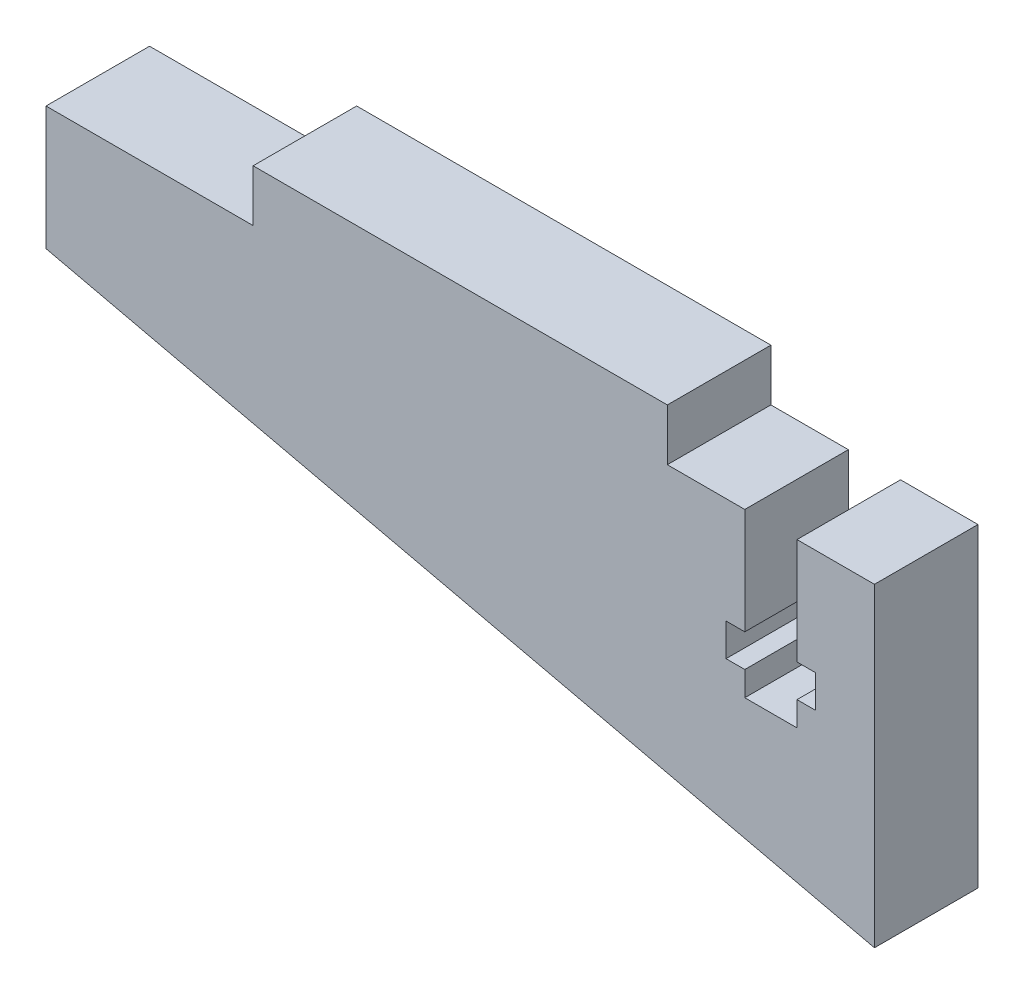
ISO-10303-21;
HEADER;
FILE_DESCRIPTION(('STEP AP214'),'2;1');
FILE_NAME('part.step','',(''),(''),'','','');
FILE_SCHEMA(('AUTOMOTIVE_DESIGN { 1 0 10303 214 1 1 1 1 }'));
ENDSEC;
DATA;
#1=APPLICATION_CONTEXT('core data for automotive mechanical design processes');
#2=APPLICATION_PROTOCOL_DEFINITION('international standard','automotive_design',2000,#1);
#3=PRODUCT_CONTEXT('',#1,'mechanical');
#4=PRODUCT('Part','Part','',(#3));
#5=PRODUCT_RELATED_PRODUCT_CATEGORY('part','',(#4));
#6=PRODUCT_DEFINITION_FORMATION('','',#4);
#7=PRODUCT_DEFINITION_CONTEXT('part definition',#1,'design');
#8=PRODUCT_DEFINITION('design','',#6,#7);
#9=PRODUCT_DEFINITION_SHAPE('','',#8);
#10=(LENGTH_UNIT() NAMED_UNIT(*) SI_UNIT(.MILLI.,.METRE.));
#11=(NAMED_UNIT(*) PLANE_ANGLE_UNIT() SI_UNIT($,.RADIAN.));
#12=(NAMED_UNIT(*) SI_UNIT($,.STERADIAN.) SOLID_ANGLE_UNIT());
#13=UNCERTAINTY_MEASURE_WITH_UNIT(LENGTH_MEASURE(1.E-05),#10,'distance_accuracy_value','');
#14=(GEOMETRIC_REPRESENTATION_CONTEXT(3) GLOBAL_UNCERTAINTY_ASSIGNED_CONTEXT((#13)) GLOBAL_UNIT_ASSIGNED_CONTEXT((#10,
#11,#12)) REPRESENTATION_CONTEXT('',''));
#15=CARTESIAN_POINT('',(0.,0.,0.));
#16=DIRECTION('',(0.,0.,1.));
#17=DIRECTION('',(1.,0.,0.));
#18=AXIS2_PLACEMENT_3D('',#15,#16,#17);
#19=CARTESIAN_POINT('',(14.9369879214621,19.13739489604,6.35));
#20=DIRECTION('',(-1.,0.,0.));
#21=DIRECTION('',(0.,0.,1.));
#22=AXIS2_PLACEMENT_3D('',#19,#20,#21);
#23=PLANE('',#22);
#24=DIRECTION('',(0.,1.,0.));
#25=VECTOR('',#24,1.);
#26=CARTESIAN_POINT('',(14.9369879214621,19.13739489604,0.));
#27=LINE('',#26,#25);
#28=CARTESIAN_POINT('',(14.9369879214621,19.13739489604,0.));
#29=VERTEX_POINT('',#28);
#30=CARTESIAN_POINT('',(14.9369879214621,22.3123948960401,0.));
#31=VERTEX_POINT('',#30);
#32=EDGE_CURVE('E201',#29,#31,#27,.T.);
#33=ORIENTED_EDGE('',*,*,#32,.F.);
#34=DIRECTION('',(0.,0.,-1.));
#35=VECTOR('',#34,1.);
#36=CARTESIAN_POINT('',(14.9369879214621,19.13739489604,6.35));
#37=LINE('',#36,#35);
#38=CARTESIAN_POINT('',(14.9369879214621,19.13739489604,6.35));
#39=VERTEX_POINT('',#38);
#40=EDGE_CURVE('E11',#39,#29,#37,.T.);
#41=ORIENTED_EDGE('',*,*,#40,.F.);
#42=DIRECTION('',(0.,1.,0.));
#43=VECTOR('',#42,1.);
#44=CARTESIAN_POINT('',(14.9369879214621,19.13739489604,6.35));
#45=LINE('',#44,#43);
#46=CARTESIAN_POINT('',(14.9369879214621,22.3123948960401,6.35));
#47=VERTEX_POINT('',#46);
#48=EDGE_CURVE('E255',#39,#47,#45,.T.);
#49=ORIENTED_EDGE('',*,*,#48,.T.);
#50=DIRECTION('',(0.,0.,-1.));
#51=VECTOR('',#50,1.);
#52=CARTESIAN_POINT('',(14.9369879214621,22.3123948960401,6.35));
#53=LINE('',#52,#51);
#54=EDGE_CURVE('E36',#47,#31,#53,.T.);
#55=ORIENTED_EDGE('',*,*,#54,.T.);
#56=EDGE_LOOP('',(#33,#41,#49,#55));
#57=FACE_BOUND('',#56,.T.);
#58=ADVANCED_FACE('F33',(#57),#23,.T.);
#59=CARTESIAN_POINT('',(2.23698792146213,19.13739489604,6.35));
#60=DIRECTION('',(0.,1.,0.));
#61=DIRECTION('',(0.,0.,1.));
#62=AXIS2_PLACEMENT_3D('',#59,#60,#61);
#63=PLANE('',#62);
#64=DIRECTION('',(1.,0.,0.));
#65=VECTOR('',#64,1.);
#66=CARTESIAN_POINT('',(2.23698792146213,19.13739489604,0.));
#67=LINE('',#66,#65);
#68=CARTESIAN_POINT('',(2.23698792146213,19.13739489604,0.));
#69=VERTEX_POINT('',#68);
#70=EDGE_CURVE('E253',#69,#29,#67,.T.);
#71=ORIENTED_EDGE('',*,*,#70,.F.);
#72=DIRECTION('',(0.,0.,-1.));
#73=VECTOR('',#72,1.);
#74=CARTESIAN_POINT('',(2.23698792146213,19.13739489604,6.35));
#75=LINE('',#74,#73);
#76=CARTESIAN_POINT('',(2.23698792146213,19.13739489604,6.35));
#77=VERTEX_POINT('',#76);
#78=EDGE_CURVE('E42',#77,#69,#75,.T.);
#79=ORIENTED_EDGE('',*,*,#78,.F.);
#80=DIRECTION('',(1.,0.,0.));
#81=VECTOR('',#80,1.);
#82=CARTESIAN_POINT('',(2.23698792146213,19.13739489604,6.35));
#83=LINE('',#82,#81);
#84=EDGE_CURVE('E190',#77,#39,#83,.T.);
#85=ORIENTED_EDGE('',*,*,#84,.T.);
#86=ORIENTED_EDGE('',*,*,#40,.T.);
#87=EDGE_LOOP('',(#71,#79,#85,#86));
#88=FACE_BOUND('',#87,.T.);
#89=ADVANCED_FACE('F294',(#88),#63,.T.);
#90=CARTESIAN_POINT('',(2.23698792146213,11.5614990052185,6.35));
#91=DIRECTION('',(-1.,0.,0.));
#92=DIRECTION('',(0.,-1.,0.));
#93=AXIS2_PLACEMENT_3D('',#90,#91,#92);
#94=PLANE('',#93);
#95=DIRECTION('',(0.,1.,0.));
#96=VECTOR('',#95,1.);
#97=CARTESIAN_POINT('',(2.23698792146213,11.5614990052185,0.));
#98=LINE('',#97,#96);
#99=CARTESIAN_POINT('',(2.23698792146213,11.5614990052185,0.));
#100=VERTEX_POINT('',#99);
#101=EDGE_CURVE('E179',#100,#69,#98,.T.);
#102=ORIENTED_EDGE('',*,*,#101,.F.);
#103=DIRECTION('',(0.,0.,-1.));
#104=VECTOR('',#103,1.);
#105=CARTESIAN_POINT('',(2.23698792146213,11.5614990052185,6.35));
#106=LINE('',#105,#104);
#107=CARTESIAN_POINT('',(2.23698792146213,11.5614990052185,6.35));
#108=VERTEX_POINT('',#107);
#109=EDGE_CURVE('E174',#108,#100,#106,.T.);
#110=ORIENTED_EDGE('',*,*,#109,.F.);
#111=DIRECTION('',(0.,1.,0.));
#112=VECTOR('',#111,1.);
#113=CARTESIAN_POINT('',(2.23698792146213,11.5614990052185,6.35));
#114=LINE('',#113,#112);
#115=EDGE_CURVE('E177',#108,#77,#114,.T.);
#116=ORIENTED_EDGE('',*,*,#115,.T.);
#117=ORIENTED_EDGE('',*,*,#78,.T.);
#118=EDGE_LOOP('',(#102,#110,#116,#117));
#119=FACE_BOUND('',#118,.T.);
#120=ADVANCED_FACE('F176',(#119),#94,.T.);
#121=CARTESIAN_POINT('',(53.0369879214621,-0.166605103959949,6.35));
#122=DIRECTION('',(-0.224951054343861,-0.974370064785236,0.));
#123=DIRECTION('',(0.974370064785236,-0.224951054343862,0.));
#124=AXIS2_PLACEMENT_3D('',#121,#122,#123);
#125=PLANE('',#124);
#126=DIRECTION('',(-0.974370064785236,0.224951054343861,0.));
#127=VECTOR('',#126,1.);
#128=CARTESIAN_POINT('',(53.0369879214621,-0.166605103959949,0.));
#129=LINE('',#128,#127);
#130=CARTESIAN_POINT('',(53.0369879214621,-0.166605103959949,0.));
#131=VERTEX_POINT('',#130);
#132=EDGE_CURVE('E250',#131,#100,#129,.T.);
#133=ORIENTED_EDGE('',*,*,#132,.F.);
#134=DIRECTION('',(0.,0.,-1.));
#135=VECTOR('',#134,1.);
#136=CARTESIAN_POINT('',(53.0369879214621,-0.166605103959949,6.35));
#137=LINE('',#136,#135);
#138=CARTESIAN_POINT('',(53.0369879214621,-0.166605103959949,6.35));
#139=VERTEX_POINT('',#138);
#140=EDGE_CURVE('E184',#139,#131,#137,.T.);
#141=ORIENTED_EDGE('',*,*,#140,.F.);
#142=DIRECTION('',(-0.974370064785236,0.224951054343861,0.));
#143=VECTOR('',#142,1.);
#144=CARTESIAN_POINT('',(53.0369879214621,-0.166605103959949,6.35));
#145=LINE('',#144,#143);
#146=EDGE_CURVE('E189',#139,#108,#145,.T.);
#147=ORIENTED_EDGE('',*,*,#146,.T.);
#148=ORIENTED_EDGE('',*,*,#109,.T.);
#149=EDGE_LOOP('',(#133,#141,#147,#148));
#150=FACE_BOUND('',#149,.T.);
#151=ADVANCED_FACE('F192',(#150),#125,.T.);
#152=CARTESIAN_POINT('',(53.0369879214621,-0.166605103959949,6.35));
#153=DIRECTION('',(-1.,0.,0.));
#154=DIRECTION('',(0.,0.,1.));
#155=AXIS2_PLACEMENT_3D('',#152,#153,#154);
#156=PLANE('',#155);
#157=DIRECTION('',(0.,1.,0.));
#158=VECTOR('',#157,1.);
#159=CARTESIAN_POINT('',(53.0369879214621,-0.166605103959949,0.));
#160=LINE('',#159,#158);
#161=CARTESIAN_POINT('',(53.0369879214621,19.13739489604,0.));
#162=VERTEX_POINT('',#161);
#163=EDGE_CURVE('E247',#131,#162,#160,.T.);
#164=ORIENTED_EDGE('',*,*,#163,.T.);
#165=DIRECTION('',(0.,0.,-1.));
#166=VECTOR('',#165,1.);
#167=CARTESIAN_POINT('',(53.0369879214621,19.13739489604,6.35));
#168=LINE('',#167,#166);
#169=CARTESIAN_POINT('',(53.0369879214621,19.13739489604,6.35));
#170=VERTEX_POINT('',#169);
#171=EDGE_CURVE('E259',#170,#162,#168,.T.);
#172=ORIENTED_EDGE('',*,*,#171,.F.);
#173=DIRECTION('',(0.,1.,0.));
#174=VECTOR('',#173,1.);
#175=CARTESIAN_POINT('',(53.0369879214621,-0.166605103959949,6.35));
#176=LINE('',#175,#174);
#177=EDGE_CURVE('E194',#139,#170,#176,.T.);
#178=ORIENTED_EDGE('',*,*,#177,.F.);
#179=ORIENTED_EDGE('',*,*,#140,.T.);
#180=EDGE_LOOP('',(#164,#172,#178,#179));
#181=FACE_BOUND('',#180,.T.);
#182=ADVANCED_FACE('F307',(#181),#156,.F.);
#183=CARTESIAN_POINT('',(48.2869879214621,19.13739489604,6.35));
#184=DIRECTION('',(0.,1.,0.));
#185=DIRECTION('',(0.,0.,1.));
#186=AXIS2_PLACEMENT_3D('',#183,#184,#185);
#187=PLANE('',#186);
#188=DIRECTION('',(1.,0.,0.));
#189=VECTOR('',#188,1.);
#190=CARTESIAN_POINT('',(48.2869879214621,19.13739489604,0.));
#191=LINE('',#190,#189);
#192=CARTESIAN_POINT('',(48.2869879214621,19.13739489604,0.));
#193=VERTEX_POINT('',#192);
#194=EDGE_CURVE('E244',#193,#162,#191,.T.);
#195=ORIENTED_EDGE('',*,*,#194,.F.);
#196=DIRECTION('',(0.,0.,-1.));
#197=VECTOR('',#196,1.);
#198=CARTESIAN_POINT('',(48.2869879214621,19.13739489604,6.35));
#199=LINE('',#198,#197);
#200=CARTESIAN_POINT('',(48.2869879214621,19.13739489604,6.35));
#201=VERTEX_POINT('',#200);
#202=EDGE_CURVE('E261',#201,#193,#199,.T.);
#203=ORIENTED_EDGE('',*,*,#202,.F.);
#204=DIRECTION('',(1.,0.,0.));
#205=VECTOR('',#204,1.);
#206=CARTESIAN_POINT('',(48.2869879214621,19.13739489604,6.35));
#207=LINE('',#206,#205);
#208=EDGE_CURVE('E196',#201,#170,#207,.T.);
#209=ORIENTED_EDGE('',*,*,#208,.T.);
#210=ORIENTED_EDGE('',*,*,#171,.T.);
#211=EDGE_LOOP('',(#195,#203,#209,#210));
#212=FACE_BOUND('',#211,.T.);
#213=ADVANCED_FACE('F310',(#212),#187,.T.);
#214=CARTESIAN_POINT('',(48.2869879214621,19.13739489604,6.35));
#215=DIRECTION('',(1.,0.,0.));
#216=DIRECTION('',(0.,0.,-1.));
#217=AXIS2_PLACEMENT_3D('',#214,#215,#216);
#218=PLANE('',#217);
#219=DIRECTION('',(0.,-1.,0.));
#220=VECTOR('',#219,1.);
#221=CARTESIAN_POINT('',(48.2869879214621,19.13739489604,0.));
#222=LINE('',#221,#220);
#223=CARTESIAN_POINT('',(48.2869879214621,12.6373948960401,0.));
#224=VERTEX_POINT('',#223);
#225=EDGE_CURVE('E242',#193,#224,#222,.T.);
#226=ORIENTED_EDGE('',*,*,#225,.T.);
#227=DIRECTION('',(0.,0.,-1.));
#228=VECTOR('',#227,1.);
#229=CARTESIAN_POINT('',(48.2869879214621,12.6373948960401,6.35));
#230=LINE('',#229,#228);
#231=CARTESIAN_POINT('',(48.2869879214621,12.6373948960401,6.35));
#232=VERTEX_POINT('',#231);
#233=EDGE_CURVE('E263',#232,#224,#230,.T.);
#234=ORIENTED_EDGE('',*,*,#233,.F.);
#235=DIRECTION('',(0.,-1.,0.));
#236=VECTOR('',#235,1.);
#237=CARTESIAN_POINT('',(48.2869879214621,19.13739489604,6.35));
#238=LINE('',#237,#236);
#239=EDGE_CURVE('E543',#201,#232,#238,.T.);
#240=ORIENTED_EDGE('',*,*,#239,.F.);
#241=ORIENTED_EDGE('',*,*,#202,.T.);
#242=EDGE_LOOP('',(#226,#234,#240,#241));
#243=FACE_BOUND('',#242,.T.);
#244=ADVANCED_FACE('F314',(#243),#218,.F.);
#245=CARTESIAN_POINT('',(48.2869879214621,12.6373948960401,6.35));
#246=DIRECTION('',(0.,1.,0.));
#247=DIRECTION('',(-1.,0.,0.));
#248=AXIS2_PLACEMENT_3D('',#245,#246,#247);
#249=PLANE('',#248);
#250=DIRECTION('',(1.,0.,0.));
#251=VECTOR('',#250,1.);
#252=CARTESIAN_POINT('',(48.2869879214621,12.6373948960401,0.));
#253=LINE('',#252,#251);
#254=CARTESIAN_POINT('',(49.4369879214621,12.6373948960401,0.));
#255=VERTEX_POINT('',#254);
#256=EDGE_CURVE('E240',#224,#255,#253,.T.);
#257=ORIENTED_EDGE('',*,*,#256,.T.);
#258=DIRECTION('',(0.,0.,-1.));
#259=VECTOR('',#258,1.);
#260=CARTESIAN_POINT('',(49.4369879214621,12.6373948960401,6.35));
#261=LINE('',#260,#259);
#262=CARTESIAN_POINT('',(49.4369879214621,12.6373948960401,6.35));
#263=VERTEX_POINT('',#262);
#264=EDGE_CURVE('E266',#263,#255,#261,.T.);
#265=ORIENTED_EDGE('',*,*,#264,.F.);
#266=DIRECTION('',(1.,0.,0.));
#267=VECTOR('',#266,1.);
#268=CARTESIAN_POINT('',(48.2869879214621,12.6373948960401,6.35));
#269=LINE('',#268,#267);
#270=EDGE_CURVE('E541',#232,#263,#269,.T.);
#271=ORIENTED_EDGE('',*,*,#270,.F.);
#272=ORIENTED_EDGE('',*,*,#233,.T.);
#273=EDGE_LOOP('',(#257,#265,#271,#272));
#274=FACE_BOUND('',#273,.T.);
#275=ADVANCED_FACE('F318',(#274),#249,.F.);
#276=CARTESIAN_POINT('',(49.4369879214621,12.6373948960401,6.35));
#277=DIRECTION('',(1.,0.,0.));
#278=DIRECTION('',(0.,0.,-1.));
#279=AXIS2_PLACEMENT_3D('',#276,#277,#278);
#280=PLANE('',#279);
#281=DIRECTION('',(0.,-1.,0.));
#282=VECTOR('',#281,1.);
#283=CARTESIAN_POINT('',(49.4369879214621,12.6373948960401,0.));
#284=LINE('',#283,#282);
#285=CARTESIAN_POINT('',(49.4369879214621,10.6373948960401,0.));
#286=VERTEX_POINT('',#285);
#287=EDGE_CURVE('E237',#255,#286,#284,.T.);
#288=ORIENTED_EDGE('',*,*,#287,.T.);
#289=DIRECTION('',(0.,0.,-1.));
#290=VECTOR('',#289,1.);
#291=CARTESIAN_POINT('',(49.4369879214621,10.6373948960401,6.35));
#292=LINE('',#291,#290);
#293=CARTESIAN_POINT('',(49.4369879214621,10.6373948960401,6.35));
#294=VERTEX_POINT('',#293);
#295=EDGE_CURVE('E269',#294,#286,#292,.T.);
#296=ORIENTED_EDGE('',*,*,#295,.F.);
#297=DIRECTION('',(0.,-1.,0.));
#298=VECTOR('',#297,1.);
#299=CARTESIAN_POINT('',(49.4369879214621,12.6373948960401,6.35));
#300=LINE('',#299,#298);
#301=EDGE_CURVE('E551',#263,#294,#300,.T.);
#302=ORIENTED_EDGE('',*,*,#301,.F.);
#303=ORIENTED_EDGE('',*,*,#264,.T.);
#304=EDGE_LOOP('',(#288,#296,#302,#303));
#305=FACE_BOUND('',#304,.T.);
#306=ADVANCED_FACE('F322',(#305),#280,.F.);
#307=CARTESIAN_POINT('',(48.2869879214621,10.63739489604,6.35));
#308=DIRECTION('',(0.,1.,0.));
#309=DIRECTION('',(-1.,0.,0.));
#310=AXIS2_PLACEMENT_3D('',#307,#308,#309);
#311=PLANE('',#310);
#312=DIRECTION('',(1.,0.,0.));
#313=VECTOR('',#312,1.);
#314=CARTESIAN_POINT('',(48.2869879214621,10.63739489604,0.));
#315=LINE('',#314,#313);
#316=CARTESIAN_POINT('',(48.2869879214621,10.63739489604,0.));
#317=VERTEX_POINT('',#316);
#318=EDGE_CURVE('E234',#317,#286,#315,.T.);
#319=ORIENTED_EDGE('',*,*,#318,.F.);
#320=DIRECTION('',(0.,0.,-1.));
#321=VECTOR('',#320,1.);
#322=CARTESIAN_POINT('',(48.2869879214621,10.63739489604,6.35));
#323=LINE('',#322,#321);
#324=CARTESIAN_POINT('',(48.2869879214621,10.63739489604,6.35));
#325=VERTEX_POINT('',#324);
#326=EDGE_CURVE('E271',#325,#317,#323,.T.);
#327=ORIENTED_EDGE('',*,*,#326,.F.);
#328=DIRECTION('',(1.,0.,0.));
#329=VECTOR('',#328,1.);
#330=CARTESIAN_POINT('',(48.2869879214621,10.63739489604,6.35));
#331=LINE('',#330,#329);
#332=EDGE_CURVE('E533',#325,#294,#331,.T.);
#333=ORIENTED_EDGE('',*,*,#332,.T.);
#334=ORIENTED_EDGE('',*,*,#295,.T.);
#335=EDGE_LOOP('',(#319,#327,#333,#334));
#336=FACE_BOUND('',#335,.T.);
#337=ADVANCED_FACE('F326',(#336),#311,.T.);
#338=CARTESIAN_POINT('',(48.2869879214621,10.63739489604,6.35));
#339=DIRECTION('',(1.,0.,0.));
#340=DIRECTION('',(0.,0.,-1.));
#341=AXIS2_PLACEMENT_3D('',#338,#339,#340);
#342=PLANE('',#341);
#343=DIRECTION('',(0.,-1.,0.));
#344=VECTOR('',#343,1.);
#345=CARTESIAN_POINT('',(48.2869879214621,10.63739489604,0.));
#346=LINE('',#345,#344);
#347=CARTESIAN_POINT('',(48.2869879214621,9.13739489604005,0.));
#348=VERTEX_POINT('',#347);
#349=EDGE_CURVE('E231',#317,#348,#346,.T.);
#350=ORIENTED_EDGE('',*,*,#349,.T.);
#351=DIRECTION('',(0.,0.,-1.));
#352=VECTOR('',#351,1.);
#353=CARTESIAN_POINT('',(48.2869879214621,9.13739489604005,6.35));
#354=LINE('',#353,#352);
#355=CARTESIAN_POINT('',(48.2869879214621,9.13739489604005,6.35));
#356=VERTEX_POINT('',#355);
#357=EDGE_CURVE('E273',#356,#348,#354,.T.);
#358=ORIENTED_EDGE('',*,*,#357,.F.);
#359=DIRECTION('',(0.,-1.,0.));
#360=VECTOR('',#359,1.);
#361=CARTESIAN_POINT('',(48.2869879214621,10.63739489604,6.35));
#362=LINE('',#361,#360);
#363=EDGE_CURVE('E554',#325,#356,#362,.T.);
#364=ORIENTED_EDGE('',*,*,#363,.F.);
#365=ORIENTED_EDGE('',*,*,#326,.T.);
#366=EDGE_LOOP('',(#350,#358,#364,#365));
#367=FACE_BOUND('',#366,.T.);
#368=ADVANCED_FACE('F330',(#367),#342,.F.);
#369=CARTESIAN_POINT('',(45.0869879214621,9.13739489604005,6.35));
#370=DIRECTION('',(0.,1.,0.));
#371=DIRECTION('',(0.,0.,1.));
#372=AXIS2_PLACEMENT_3D('',#369,#370,#371);
#373=PLANE('',#372);
#374=DIRECTION('',(1.,0.,0.));
#375=VECTOR('',#374,1.);
#376=CARTESIAN_POINT('',(45.0869879214621,9.13739489604005,0.));
#377=LINE('',#376,#375);
#378=CARTESIAN_POINT('',(45.0869879214621,9.13739489604005,0.));
#379=VERTEX_POINT('',#378);
#380=EDGE_CURVE('E228',#379,#348,#377,.T.);
#381=ORIENTED_EDGE('',*,*,#380,.F.);
#382=DIRECTION('',(0.,0.,-1.));
#383=VECTOR('',#382,1.);
#384=CARTESIAN_POINT('',(45.0869879214621,9.13739489604005,6.35));
#385=LINE('',#384,#383);
#386=CARTESIAN_POINT('',(45.0869879214621,9.13739489604005,6.35));
#387=VERTEX_POINT('',#386);
#388=EDGE_CURVE('E275',#387,#379,#385,.T.);
#389=ORIENTED_EDGE('',*,*,#388,.F.);
#390=DIRECTION('',(1.,0.,0.));
#391=VECTOR('',#390,1.);
#392=CARTESIAN_POINT('',(45.0869879214621,9.13739489604005,6.35));
#393=LINE('',#392,#391);
#394=EDGE_CURVE('E556',#387,#356,#393,.T.);
#395=ORIENTED_EDGE('',*,*,#394,.T.);
#396=ORIENTED_EDGE('',*,*,#357,.T.);
#397=EDGE_LOOP('',(#381,#389,#395,#396));
#398=FACE_BOUND('',#397,.T.);
#399=ADVANCED_FACE('F334',(#398),#373,.T.);
#400=CARTESIAN_POINT('',(45.0869879214621,10.63739489604,6.35));
#401=DIRECTION('',(1.,0.,0.));
#402=DIRECTION('',(0.,0.,-1.));
#403=AXIS2_PLACEMENT_3D('',#400,#401,#402);
#404=PLANE('',#403);
#405=DIRECTION('',(0.,-1.,0.));
#406=VECTOR('',#405,1.);
#407=CARTESIAN_POINT('',(45.0869879214621,10.63739489604,0.));
#408=LINE('',#407,#406);
#409=CARTESIAN_POINT('',(45.0869879214621,10.63739489604,0.));
#410=VERTEX_POINT('',#409);
#411=EDGE_CURVE('E225',#410,#379,#408,.T.);
#412=ORIENTED_EDGE('',*,*,#411,.F.);
#413=DIRECTION('',(0.,0.,-1.));
#414=VECTOR('',#413,1.);
#415=CARTESIAN_POINT('',(45.0869879214621,10.63739489604,6.35));
#416=LINE('',#415,#414);
#417=CARTESIAN_POINT('',(45.0869879214621,10.63739489604,6.35));
#418=VERTEX_POINT('',#417);
#419=EDGE_CURVE('E277',#418,#410,#416,.T.);
#420=ORIENTED_EDGE('',*,*,#419,.F.);
#421=DIRECTION('',(0.,-1.,0.));
#422=VECTOR('',#421,1.);
#423=CARTESIAN_POINT('',(45.0869879214621,10.63739489604,6.35));
#424=LINE('',#423,#422);
#425=EDGE_CURVE('E522',#418,#387,#424,.T.);
#426=ORIENTED_EDGE('',*,*,#425,.T.);
#427=ORIENTED_EDGE('',*,*,#388,.T.);
#428=EDGE_LOOP('',(#412,#420,#426,#427));
#429=FACE_BOUND('',#428,.T.);
#430=ADVANCED_FACE('F338',(#429),#404,.T.);
#431=CARTESIAN_POINT('',(45.0869879214621,10.63739489604,6.35));
#432=DIRECTION('',(0.,-1.,0.));
#433=DIRECTION('',(0.,0.,-1.));
#434=AXIS2_PLACEMENT_3D('',#431,#432,#433);
#435=PLANE('',#434);
#436=DIRECTION('',(-1.,0.,0.));
#437=VECTOR('',#436,1.);
#438=CARTESIAN_POINT('',(45.0869879214621,10.63739489604,0.));
#439=LINE('',#438,#437);
#440=CARTESIAN_POINT('',(43.9369879214621,10.63739489604,0.));
#441=VERTEX_POINT('',#440);
#442=EDGE_CURVE('E222',#410,#441,#439,.T.);
#443=ORIENTED_EDGE('',*,*,#442,.T.);
#444=DIRECTION('',(0.,0.,-1.));
#445=VECTOR('',#444,1.);
#446=CARTESIAN_POINT('',(43.9369879214621,10.63739489604,6.35));
#447=LINE('',#446,#445);
#448=CARTESIAN_POINT('',(43.9369879214621,10.63739489604,6.35));
#449=VERTEX_POINT('',#448);
#450=EDGE_CURVE('E279',#449,#441,#447,.T.);
#451=ORIENTED_EDGE('',*,*,#450,.F.);
#452=DIRECTION('',(-1.,0.,0.));
#453=VECTOR('',#452,1.);
#454=CARTESIAN_POINT('',(45.0869879214621,10.63739489604,6.35));
#455=LINE('',#454,#453);
#456=EDGE_CURVE('E559',#418,#449,#455,.T.);
#457=ORIENTED_EDGE('',*,*,#456,.F.);
#458=ORIENTED_EDGE('',*,*,#419,.T.);
#459=EDGE_LOOP('',(#443,#451,#457,#458));
#460=FACE_BOUND('',#459,.T.);
#461=ADVANCED_FACE('F342',(#460),#435,.F.);
#462=CARTESIAN_POINT('',(43.9369879214621,12.6373948960401,6.35));
#463=DIRECTION('',(1.,0.,0.));
#464=DIRECTION('',(0.,0.,-1.));
#465=AXIS2_PLACEMENT_3D('',#462,#463,#464);
#466=PLANE('',#465);
#467=DIRECTION('',(0.,-1.,0.));
#468=VECTOR('',#467,1.);
#469=CARTESIAN_POINT('',(43.9369879214621,12.6373948960401,0.));
#470=LINE('',#469,#468);
#471=CARTESIAN_POINT('',(43.9369879214621,12.6373948960401,0.));
#472=VERTEX_POINT('',#471);
#473=EDGE_CURVE('E219',#472,#441,#470,.T.);
#474=ORIENTED_EDGE('',*,*,#473,.F.);
#475=DIRECTION('',(0.,0.,-1.));
#476=VECTOR('',#475,1.);
#477=CARTESIAN_POINT('',(43.9369879214621,12.6373948960401,6.35));
#478=LINE('',#477,#476);
#479=CARTESIAN_POINT('',(43.9369879214621,12.6373948960401,6.35));
#480=VERTEX_POINT('',#479);
#481=EDGE_CURVE('E281',#480,#472,#478,.T.);
#482=ORIENTED_EDGE('',*,*,#481,.F.);
#483=DIRECTION('',(0.,-1.,0.));
#484=VECTOR('',#483,1.);
#485=CARTESIAN_POINT('',(43.9369879214621,12.6373948960401,6.35));
#486=LINE('',#485,#484);
#487=EDGE_CURVE('E516',#480,#449,#486,.T.);
#488=ORIENTED_EDGE('',*,*,#487,.T.);
#489=ORIENTED_EDGE('',*,*,#450,.T.);
#490=EDGE_LOOP('',(#474,#482,#488,#489));
#491=FACE_BOUND('',#490,.T.);
#492=ADVANCED_FACE('F346',(#491),#466,.T.);
#493=CARTESIAN_POINT('',(45.0869879214621,12.6373948960401,6.35));
#494=DIRECTION('',(0.,-1.,0.));
#495=DIRECTION('',(0.,0.,-1.));
#496=AXIS2_PLACEMENT_3D('',#493,#494,#495);
#497=PLANE('',#496);
#498=DIRECTION('',(-1.,0.,0.));
#499=VECTOR('',#498,1.);
#500=CARTESIAN_POINT('',(45.0869879214621,12.6373948960401,0.));
#501=LINE('',#500,#499);
#502=CARTESIAN_POINT('',(45.0869879214621,12.6373948960401,0.));
#503=VERTEX_POINT('',#502);
#504=EDGE_CURVE('E216',#503,#472,#501,.T.);
#505=ORIENTED_EDGE('',*,*,#504,.F.);
#506=DIRECTION('',(0.,0.,-1.));
#507=VECTOR('',#506,1.);
#508=CARTESIAN_POINT('',(45.0869879214621,12.6373948960401,6.35));
#509=LINE('',#508,#507);
#510=CARTESIAN_POINT('',(45.0869879214621,12.6373948960401,6.35));
#511=VERTEX_POINT('',#510);
#512=EDGE_CURVE('E283',#511,#503,#509,.T.);
#513=ORIENTED_EDGE('',*,*,#512,.F.);
#514=DIRECTION('',(-1.,0.,0.));
#515=VECTOR('',#514,1.);
#516=CARTESIAN_POINT('',(45.0869879214621,12.6373948960401,6.35));
#517=LINE('',#516,#515);
#518=EDGE_CURVE('E512',#511,#480,#517,.T.);
#519=ORIENTED_EDGE('',*,*,#518,.T.);
#520=ORIENTED_EDGE('',*,*,#481,.T.);
#521=EDGE_LOOP('',(#505,#513,#519,#520));
#522=FACE_BOUND('',#521,.T.);
#523=ADVANCED_FACE('F350',(#522),#497,.T.);
#524=CARTESIAN_POINT('',(45.0869879214621,19.13739489604,6.35));
#525=DIRECTION('',(1.,0.,0.));
#526=DIRECTION('',(0.,0.,-1.));
#527=AXIS2_PLACEMENT_3D('',#524,#525,#526);
#528=PLANE('',#527);
#529=DIRECTION('',(0.,-1.,0.));
#530=VECTOR('',#529,1.);
#531=CARTESIAN_POINT('',(45.0869879214621,19.13739489604,0.));
#532=LINE('',#531,#530);
#533=CARTESIAN_POINT('',(45.0869879214621,19.13739489604,0.));
#534=VERTEX_POINT('',#533);
#535=EDGE_CURVE('E213',#534,#503,#532,.T.);
#536=ORIENTED_EDGE('',*,*,#535,.F.);
#537=DIRECTION('',(0.,0.,-1.));
#538=VECTOR('',#537,1.);
#539=CARTESIAN_POINT('',(45.0869879214621,19.13739489604,6.35));
#540=LINE('',#539,#538);
#541=CARTESIAN_POINT('',(45.0869879214621,19.13739489604,6.35));
#542=VERTEX_POINT('',#541);
#543=EDGE_CURVE('E285',#542,#534,#540,.T.);
#544=ORIENTED_EDGE('',*,*,#543,.F.);
#545=DIRECTION('',(0.,-1.,0.));
#546=VECTOR('',#545,1.);
#547=CARTESIAN_POINT('',(45.0869879214621,19.13739489604,6.35));
#548=LINE('',#547,#546);
#549=EDGE_CURVE('E563',#542,#511,#548,.T.);
#550=ORIENTED_EDGE('',*,*,#549,.T.);
#551=ORIENTED_EDGE('',*,*,#512,.T.);
#552=EDGE_LOOP('',(#536,#544,#550,#551));
#553=FACE_BOUND('',#552,.T.);
#554=ADVANCED_FACE('F354',(#553),#528,.T.);
#555=CARTESIAN_POINT('',(40.3369879214621,19.13739489604,6.35));
#556=DIRECTION('',(0.,1.,0.));
#557=DIRECTION('',(0.,0.,1.));
#558=AXIS2_PLACEMENT_3D('',#555,#556,#557);
#559=PLANE('',#558);
#560=DIRECTION('',(1.,0.,0.));
#561=VECTOR('',#560,1.);
#562=CARTESIAN_POINT('',(40.3369879214621,19.13739489604,0.));
#563=LINE('',#562,#561);
#564=CARTESIAN_POINT('',(40.3369879214621,19.13739489604,0.));
#565=VERTEX_POINT('',#564);
#566=EDGE_CURVE('E210',#565,#534,#563,.T.);
#567=ORIENTED_EDGE('',*,*,#566,.F.);
#568=DIRECTION('',(0.,0.,-1.));
#569=VECTOR('',#568,1.);
#570=CARTESIAN_POINT('',(40.3369879214621,19.13739489604,6.35));
#571=LINE('',#570,#569);
#572=CARTESIAN_POINT('',(40.3369879214621,19.13739489604,6.35));
#573=VERTEX_POINT('',#572);
#574=EDGE_CURVE('E287',#573,#565,#571,.T.);
#575=ORIENTED_EDGE('',*,*,#574,.F.);
#576=DIRECTION('',(1.,0.,0.));
#577=VECTOR('',#576,1.);
#578=CARTESIAN_POINT('',(40.3369879214621,19.13739489604,6.35));
#579=LINE('',#578,#577);
#580=EDGE_CURVE('E504',#573,#542,#579,.T.);
#581=ORIENTED_EDGE('',*,*,#580,.T.);
#582=ORIENTED_EDGE('',*,*,#543,.T.);
#583=EDGE_LOOP('',(#567,#575,#581,#582));
#584=FACE_BOUND('',#583,.T.);
#585=ADVANCED_FACE('F358',(#584),#559,.T.);
#586=CARTESIAN_POINT('',(40.3369879214621,19.13739489604,6.35));
#587=DIRECTION('',(-1.,0.,0.));
#588=DIRECTION('',(0.,0.,1.));
#589=AXIS2_PLACEMENT_3D('',#586,#587,#588);
#590=PLANE('',#589);
#591=DIRECTION('',(0.,1.,0.));
#592=VECTOR('',#591,1.);
#593=CARTESIAN_POINT('',(40.3369879214621,19.13739489604,0.));
#594=LINE('',#593,#592);
#595=CARTESIAN_POINT('',(40.3369879214621,22.3123948960401,0.));
#596=VERTEX_POINT('',#595);
#597=EDGE_CURVE('E207',#565,#596,#594,.T.);
#598=ORIENTED_EDGE('',*,*,#597,.T.);
#599=DIRECTION('',(0.,0.,-1.));
#600=VECTOR('',#599,1.);
#601=CARTESIAN_POINT('',(40.3369879214621,22.3123948960401,6.35));
#602=LINE('',#601,#600);
#603=CARTESIAN_POINT('',(40.3369879214621,22.3123948960401,6.35));
#604=VERTEX_POINT('',#603);
#605=EDGE_CURVE('E288',#604,#596,#602,.T.);
#606=ORIENTED_EDGE('',*,*,#605,.F.);
#607=DIRECTION('',(0.,1.,0.));
#608=VECTOR('',#607,1.);
#609=CARTESIAN_POINT('',(40.3369879214621,19.13739489604,6.35));
#610=LINE('',#609,#608);
#611=EDGE_CURVE('E566',#573,#604,#610,.T.);
#612=ORIENTED_EDGE('',*,*,#611,.F.);
#613=ORIENTED_EDGE('',*,*,#574,.T.);
#614=EDGE_LOOP('',(#598,#606,#612,#613));
#615=FACE_BOUND('',#614,.T.);
#616=ADVANCED_FACE('F362',(#615),#590,.F.);
#617=CARTESIAN_POINT('',(14.9369879214621,22.3123948960401,6.35));
#618=DIRECTION('',(0.,1.,0.));
#619=DIRECTION('',(0.,0.,1.));
#620=AXIS2_PLACEMENT_3D('',#617,#618,#619);
#621=PLANE('',#620);
#622=DIRECTION('',(1.,0.,0.));
#623=VECTOR('',#622,1.);
#624=CARTESIAN_POINT('',(14.9369879214621,22.3123948960401,0.));
#625=LINE('',#624,#623);
#626=EDGE_CURVE('E204',#31,#596,#625,.T.);
#627=ORIENTED_EDGE('',*,*,#626,.F.);
#628=ORIENTED_EDGE('',*,*,#54,.F.);
#629=DIRECTION('',(1.,0.,0.));
#630=VECTOR('',#629,1.);
#631=CARTESIAN_POINT('',(14.9369879214621,22.3123948960401,6.35));
#632=LINE('',#631,#630);
#633=EDGE_CURVE('E568',#47,#604,#632,.T.);
#634=ORIENTED_EDGE('',*,*,#633,.T.);
#635=ORIENTED_EDGE('',*,*,#605,.T.);
#636=EDGE_LOOP('',(#627,#628,#634,#635));
#637=FACE_BOUND('',#636,.T.);
#638=ADVANCED_FACE('F290',(#637),#621,.T.);
#639=CARTESIAN_POINT('',(0.,0.,6.35));
#640=DIRECTION('',(0.,0.,-1.));
#641=DIRECTION('',(-1.,0.,0.));
#642=AXIS2_PLACEMENT_3D('',#639,#640,#641);
#643=PLANE('',#642);
#644=ORIENTED_EDGE('',*,*,#48,.F.);
#645=ORIENTED_EDGE('',*,*,#84,.F.);
#646=ORIENTED_EDGE('',*,*,#115,.F.);
#647=ORIENTED_EDGE('',*,*,#146,.F.);
#648=ORIENTED_EDGE('',*,*,#177,.T.);
#649=ORIENTED_EDGE('',*,*,#208,.F.);
#650=ORIENTED_EDGE('',*,*,#239,.T.);
#651=ORIENTED_EDGE('',*,*,#270,.T.);
#652=ORIENTED_EDGE('',*,*,#301,.T.);
#653=ORIENTED_EDGE('',*,*,#332,.F.);
#654=ORIENTED_EDGE('',*,*,#363,.T.);
#655=ORIENTED_EDGE('',*,*,#394,.F.);
#656=ORIENTED_EDGE('',*,*,#425,.F.);
#657=ORIENTED_EDGE('',*,*,#456,.T.);
#658=ORIENTED_EDGE('',*,*,#487,.F.);
#659=ORIENTED_EDGE('',*,*,#518,.F.);
#660=ORIENTED_EDGE('',*,*,#549,.F.);
#661=ORIENTED_EDGE('',*,*,#580,.F.);
#662=ORIENTED_EDGE('',*,*,#611,.T.);
#663=ORIENTED_EDGE('',*,*,#633,.F.);
#664=EDGE_LOOP('',(#644,#645,#646,#647,#648,#649,#650,#651,#652,#653,#654,#655,#656,#657,#658,
#659,#660,#661,#662,#663));
#665=FACE_BOUND('',#664,.T.);
#666=ADVANCED_FACE('F188',(#665),#643,.F.);
#667=CARTESIAN_POINT('',(0.,0.,0.));
#668=DIRECTION('',(0.,0.,-1.));
#669=DIRECTION('',(-1.,0.,0.));
#670=AXIS2_PLACEMENT_3D('',#667,#668,#669);
#671=PLANE('',#670);
#672=ORIENTED_EDGE('',*,*,#32,.T.);
#673=ORIENTED_EDGE('',*,*,#626,.T.);
#674=ORIENTED_EDGE('',*,*,#597,.F.);
#675=ORIENTED_EDGE('',*,*,#566,.T.);
#676=ORIENTED_EDGE('',*,*,#535,.T.);
#677=ORIENTED_EDGE('',*,*,#504,.T.);
#678=ORIENTED_EDGE('',*,*,#473,.T.);
#679=ORIENTED_EDGE('',*,*,#442,.F.);
#680=ORIENTED_EDGE('',*,*,#411,.T.);
#681=ORIENTED_EDGE('',*,*,#380,.T.);
#682=ORIENTED_EDGE('',*,*,#349,.F.);
#683=ORIENTED_EDGE('',*,*,#318,.T.);
#684=ORIENTED_EDGE('',*,*,#287,.F.);
#685=ORIENTED_EDGE('',*,*,#256,.F.);
#686=ORIENTED_EDGE('',*,*,#225,.F.);
#687=ORIENTED_EDGE('',*,*,#194,.T.);
#688=ORIENTED_EDGE('',*,*,#163,.F.);
#689=ORIENTED_EDGE('',*,*,#132,.T.);
#690=ORIENTED_EDGE('',*,*,#101,.T.);
#691=ORIENTED_EDGE('',*,*,#70,.T.);
#692=EDGE_LOOP('',(#672,#673,#674,#675,#676,#677,#678,#679,#680,#681,#682,#683,#684,#685,#686,
#687,#688,#689,#690,#691));
#693=FACE_BOUND('',#692,.T.);
#694=ADVANCED_FACE('F293',(#693),#671,.T.);
#695=CLOSED_SHELL('',(#58,#89,#120,#151,#182,#213,#244,#275,#306,#337,#368,#399,#430,#461,#492,
#523,#554,#585,#616,#638,#666,#694));
#696=MANIFOLD_SOLID_BREP('B2',#695);
#697=ADVANCED_BREP_SHAPE_REPRESENTATION('',(#18,#696),#14);
#698=SHAPE_DEFINITION_REPRESENTATION(#9,#697);
ENDSEC;
END-ISO-10303-21;
